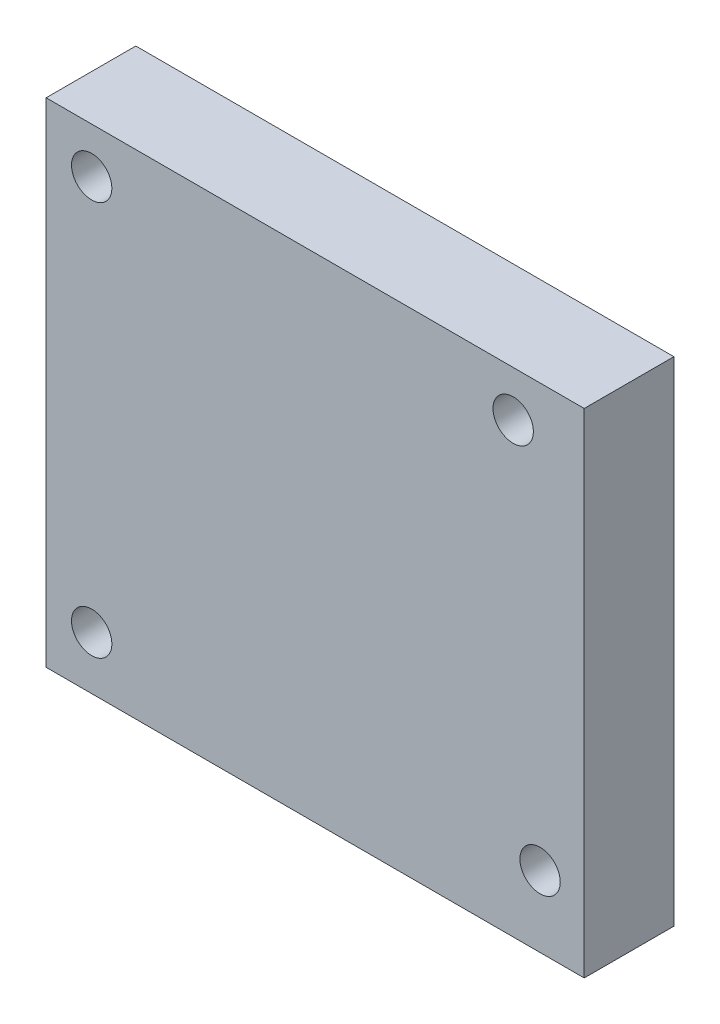
ISO-10303-21;
HEADER;
FILE_DESCRIPTION(('STEP AP214'),'2;1');
FILE_NAME('part.step','',(''),(''),'','','');
FILE_SCHEMA(('AUTOMOTIVE_DESIGN { 1 0 10303 214 1 1 1 1 }'));
ENDSEC;
DATA;
#1=APPLICATION_CONTEXT('core data for automotive mechanical design processes');
#2=APPLICATION_PROTOCOL_DEFINITION('international standard','automotive_design',2000,#1);
#3=PRODUCT_CONTEXT('',#1,'mechanical');
#4=PRODUCT('Part','Part','',(#3));
#5=PRODUCT_RELATED_PRODUCT_CATEGORY('part','',(#4));
#6=PRODUCT_DEFINITION_FORMATION('','',#4);
#7=PRODUCT_DEFINITION_CONTEXT('part definition',#1,'design');
#8=PRODUCT_DEFINITION('design','',#6,#7);
#9=PRODUCT_DEFINITION_SHAPE('','',#8);
#10=(LENGTH_UNIT() NAMED_UNIT(*) SI_UNIT(.MILLI.,.METRE.));
#11=(NAMED_UNIT(*) PLANE_ANGLE_UNIT() SI_UNIT($,.RADIAN.));
#12=(NAMED_UNIT(*) SI_UNIT($,.STERADIAN.) SOLID_ANGLE_UNIT());
#13=UNCERTAINTY_MEASURE_WITH_UNIT(LENGTH_MEASURE(1.E-05),#10,'distance_accuracy_value','');
#14=(GEOMETRIC_REPRESENTATION_CONTEXT(3) GLOBAL_UNCERTAINTY_ASSIGNED_CONTEXT((#13)) GLOBAL_UNIT_ASSIGNED_CONTEXT((#10,
#11,#12)) REPRESENTATION_CONTEXT('',''));
#15=CARTESIAN_POINT('',(0.,0.,0.));
#16=DIRECTION('',(0.,0.,1.));
#17=DIRECTION('',(1.,0.,0.));
#18=AXIS2_PLACEMENT_3D('',#15,#16,#17);
#19=CARTESIAN_POINT('',(0.,0.,10.));
#20=DIRECTION('',(0.,0.,-1.));
#21=DIRECTION('',(-1.,0.,0.));
#22=AXIS2_PLACEMENT_3D('',#19,#20,#21);
#23=PLANE('',#22);
#24=DIRECTION('',(0.,1.,0.));
#25=VECTOR('',#24,1.);
#26=CARTESIAN_POINT('',(29.999999944,-30.,10.));
#27=LINE('',#26,#25);
#28=CARTESIAN_POINT('',(29.999999944,-30.,10.));
#29=VERTEX_POINT('',#28);
#30=CARTESIAN_POINT('',(29.999999944,25.,10.));
#31=VERTEX_POINT('',#30);
#32=EDGE_CURVE('E85',#29,#31,#27,.T.);
#33=ORIENTED_EDGE('',*,*,#32,.T.);
#34=DIRECTION('',(-1.,0.,0.));
#35=VECTOR('',#34,1.);
#36=CARTESIAN_POINT('',(-29.999999944,25.,10.));
#37=LINE('',#36,#35);
#38=CARTESIAN_POINT('',(-29.999999944,25.,10.));
#39=VERTEX_POINT('',#38);
#40=EDGE_CURVE('E80',#31,#39,#37,.T.);
#41=ORIENTED_EDGE('',*,*,#40,.T.);
#42=DIRECTION('',(0.,-1.,0.));
#43=VECTOR('',#42,1.);
#44=CARTESIAN_POINT('',(-29.999999944,-30.,10.));
#45=LINE('',#44,#43);
#46=CARTESIAN_POINT('',(-29.999999944,-30.,10.));
#47=VERTEX_POINT('',#46);
#48=EDGE_CURVE('E83',#39,#47,#45,.T.);
#49=ORIENTED_EDGE('',*,*,#48,.T.);
#50=DIRECTION('',(1.,0.,0.));
#51=VECTOR('',#50,1.);
#52=CARTESIAN_POINT('',(-29.999999944,-30.,10.));
#53=LINE('',#52,#51);
#54=EDGE_CURVE('E50',#47,#29,#53,.T.);
#55=ORIENTED_EDGE('',*,*,#54,.T.);
#56=EDGE_LOOP('',(#33,#41,#49,#55));
#57=FACE_BOUND('',#56,.T.);
#58=CARTESIAN_POINT('',(-24.919999944,19.92,10.));
#59=DIRECTION('',(0.,0.,1.));
#60=DIRECTION('',(1.,0.,0.));
#61=AXIS2_PLACEMENT_3D('',#58,#59,#60);
#62=CIRCLE('',#61,2.25);
#63=CARTESIAN_POINT('',(-22.669999944,19.92,10.));
#64=VERTEX_POINT('',#63);
#65=EDGE_CURVE('E100',#64,#64,#62,.T.);
#66=ORIENTED_EDGE('',*,*,#65,.F.);
#67=EDGE_LOOP('',(#66));
#68=FACE_BOUND('',#67,.T.);
#69=CARTESIAN_POINT('',(-24.919999944,-24.08,10.));
#70=DIRECTION('',(0.,0.,1.));
#71=DIRECTION('',(1.,0.,0.));
#72=AXIS2_PLACEMENT_3D('',#69,#70,#71);
#73=CIRCLE('',#72,2.25);
#74=CARTESIAN_POINT('',(-22.669999944,-24.08,10.));
#75=VERTEX_POINT('',#74);
#76=EDGE_CURVE('E115',#75,#75,#73,.T.);
#77=ORIENTED_EDGE('',*,*,#76,.F.);
#78=EDGE_LOOP('',(#77));
#79=FACE_BOUND('',#78,.T.);
#80=CARTESIAN_POINT('',(25.080000056,-22.08,10.));
#81=DIRECTION('',(0.,0.,1.));
#82=DIRECTION('',(1.,0.,0.));
#83=AXIS2_PLACEMENT_3D('',#80,#81,#82);
#84=CIRCLE('',#83,2.25);
#85=CARTESIAN_POINT('',(27.330000056,-22.08,10.));
#86=VERTEX_POINT('',#85);
#87=EDGE_CURVE('E121',#86,#86,#84,.T.);
#88=ORIENTED_EDGE('',*,*,#87,.F.);
#89=EDGE_LOOP('',(#88));
#90=FACE_BOUND('',#89,.T.);
#91=CARTESIAN_POINT('',(22.080000056,19.92,10.));
#92=DIRECTION('',(0.,0.,1.));
#93=DIRECTION('',(1.,0.,0.));
#94=AXIS2_PLACEMENT_3D('',#91,#92,#93);
#95=CIRCLE('',#94,2.25);
#96=CARTESIAN_POINT('',(24.330000056,19.92,10.));
#97=VERTEX_POINT('',#96);
#98=EDGE_CURVE('E127',#97,#97,#95,.T.);
#99=ORIENTED_EDGE('',*,*,#98,.F.);
#100=EDGE_LOOP('',(#99));
#101=FACE_BOUND('',#100,.T.);
#102=ADVANCED_FACE('F33',(#57,#68,#79,#90,#101),#23,.F.);
#103=CARTESIAN_POINT('',(0.,0.,0.));
#104=DIRECTION('',(0.,0.,-1.));
#105=DIRECTION('',(-1.,0.,0.));
#106=AXIS2_PLACEMENT_3D('',#103,#104,#105);
#107=PLANE('',#106);
#108=CARTESIAN_POINT('',(25.080000056,-22.08,0.));
#109=DIRECTION('',(0.,0.,1.));
#110=DIRECTION('',(1.,0.,0.));
#111=AXIS2_PLACEMENT_3D('',#108,#109,#110);
#112=CIRCLE('',#111,2.25);
#113=CARTESIAN_POINT('',(27.330000056,-22.08,0.));
#114=VERTEX_POINT('',#113);
#115=EDGE_CURVE('E124',#114,#114,#112,.T.);
#116=ORIENTED_EDGE('',*,*,#115,.T.);
#117=EDGE_LOOP('',(#116));
#118=FACE_BOUND('',#117,.T.);
#119=CARTESIAN_POINT('',(-24.919999944,19.92,0.));
#120=DIRECTION('',(0.,0.,1.));
#121=DIRECTION('',(1.,0.,0.));
#122=AXIS2_PLACEMENT_3D('',#119,#120,#121);
#123=CIRCLE('',#122,2.25);
#124=CARTESIAN_POINT('',(-22.669999944,19.92,0.));
#125=VERTEX_POINT('',#124);
#126=EDGE_CURVE('E112',#125,#125,#123,.T.);
#127=ORIENTED_EDGE('',*,*,#126,.T.);
#128=EDGE_LOOP('',(#127));
#129=FACE_BOUND('',#128,.T.);
#130=DIRECTION('',(0.,1.,0.));
#131=VECTOR('',#130,1.);
#132=CARTESIAN_POINT('',(29.999999944,-30.,0.));
#133=LINE('',#132,#131);
#134=CARTESIAN_POINT('',(29.999999944,-30.,0.));
#135=VERTEX_POINT('',#134);
#136=CARTESIAN_POINT('',(29.999999944,25.,0.));
#137=VERTEX_POINT('',#136);
#138=EDGE_CURVE('E97',#135,#137,#133,.T.);
#139=ORIENTED_EDGE('',*,*,#138,.F.);
#140=DIRECTION('',(1.,0.,0.));
#141=VECTOR('',#140,1.);
#142=CARTESIAN_POINT('',(-29.999999944,-30.,0.));
#143=LINE('',#142,#141);
#144=CARTESIAN_POINT('',(-29.999999944,-30.,0.));
#145=VERTEX_POINT('',#144);
#146=EDGE_CURVE('E73',#145,#135,#143,.T.);
#147=ORIENTED_EDGE('',*,*,#146,.F.);
#148=DIRECTION('',(0.,-1.,0.));
#149=VECTOR('',#148,1.);
#150=CARTESIAN_POINT('',(-29.999999944,-30.,0.));
#151=LINE('',#150,#149);
#152=CARTESIAN_POINT('',(-29.999999944,25.,0.));
#153=VERTEX_POINT('',#152);
#154=EDGE_CURVE('E67',#153,#145,#151,.T.);
#155=ORIENTED_EDGE('',*,*,#154,.F.);
#156=DIRECTION('',(-1.,0.,0.));
#157=VECTOR('',#156,1.);
#158=CARTESIAN_POINT('',(-29.999999944,25.,0.));
#159=LINE('',#158,#157);
#160=EDGE_CURVE('E89',#137,#153,#159,.T.);
#161=ORIENTED_EDGE('',*,*,#160,.F.);
#162=EDGE_LOOP('',(#139,#147,#155,#161));
#163=FACE_BOUND('',#162,.T.);
#164=CARTESIAN_POINT('',(-24.919999944,-24.08,0.));
#165=DIRECTION('',(0.,0.,1.));
#166=DIRECTION('',(1.,0.,0.));
#167=AXIS2_PLACEMENT_3D('',#164,#165,#166);
#168=CIRCLE('',#167,2.25);
#169=CARTESIAN_POINT('',(-22.669999944,-24.08,0.));
#170=VERTEX_POINT('',#169);
#171=EDGE_CURVE('E118',#170,#170,#168,.T.);
#172=ORIENTED_EDGE('',*,*,#171,.T.);
#173=EDGE_LOOP('',(#172));
#174=FACE_BOUND('',#173,.T.);
#175=CARTESIAN_POINT('',(22.080000056,19.92,0.));
#176=DIRECTION('',(0.,0.,1.));
#177=DIRECTION('',(1.,0.,0.));
#178=AXIS2_PLACEMENT_3D('',#175,#176,#177);
#179=CIRCLE('',#178,2.25);
#180=CARTESIAN_POINT('',(24.330000056,19.92,0.));
#181=VERTEX_POINT('',#180);
#182=EDGE_CURVE('E130',#181,#181,#179,.T.);
#183=ORIENTED_EDGE('',*,*,#182,.T.);
#184=EDGE_LOOP('',(#183));
#185=FACE_BOUND('',#184,.T.);
#186=ADVANCED_FACE('F108',(#118,#129,#163,#174,#185),#107,.T.);
#187=CARTESIAN_POINT('',(29.999999944,-30.,10.));
#188=DIRECTION('',(-1.,0.,0.));
#189=DIRECTION('',(0.,-1.,0.));
#190=AXIS2_PLACEMENT_3D('',#187,#188,#189);
#191=PLANE('',#190);
#192=ORIENTED_EDGE('',*,*,#138,.T.);
#193=DIRECTION('',(0.,0.,-1.));
#194=VECTOR('',#193,1.);
#195=CARTESIAN_POINT('',(29.999999944,25.,10.));
#196=LINE('',#195,#194);
#197=EDGE_CURVE('E11',#31,#137,#196,.T.);
#198=ORIENTED_EDGE('',*,*,#197,.F.);
#199=ORIENTED_EDGE('',*,*,#32,.F.);
#200=DIRECTION('',(0.,0.,-1.));
#201=VECTOR('',#200,1.);
#202=CARTESIAN_POINT('',(29.999999944,-30.,10.));
#203=LINE('',#202,#201);
#204=EDGE_CURVE('E93',#29,#135,#203,.T.);
#205=ORIENTED_EDGE('',*,*,#204,.T.);
#206=EDGE_LOOP('',(#192,#198,#199,#205));
#207=FACE_BOUND('',#206,.T.);
#208=ADVANCED_FACE('F35',(#207),#191,.F.);
#209=CARTESIAN_POINT('',(-29.999999944,25.,10.));
#210=DIRECTION('',(0.,-1.,0.));
#211=DIRECTION('',(1.,0.,0.));
#212=AXIS2_PLACEMENT_3D('',#209,#210,#211);
#213=PLANE('',#212);
#214=ORIENTED_EDGE('',*,*,#160,.T.);
#215=DIRECTION('',(0.,0.,-1.));
#216=VECTOR('',#215,1.);
#217=CARTESIAN_POINT('',(-29.999999944,25.,10.));
#218=LINE('',#217,#216);
#219=EDGE_CURVE('E42',#39,#153,#218,.T.);
#220=ORIENTED_EDGE('',*,*,#219,.F.);
#221=ORIENTED_EDGE('',*,*,#40,.F.);
#222=ORIENTED_EDGE('',*,*,#197,.T.);
#223=EDGE_LOOP('',(#214,#220,#221,#222));
#224=FACE_BOUND('',#223,.T.);
#225=ADVANCED_FACE('F88',(#224),#213,.F.);
#226=CARTESIAN_POINT('',(-29.999999944,-30.,10.));
#227=DIRECTION('',(1.,0.,0.));
#228=DIRECTION('',(0.,1.,0.));
#229=AXIS2_PLACEMENT_3D('',#226,#227,#228);
#230=PLANE('',#229);
#231=ORIENTED_EDGE('',*,*,#154,.T.);
#232=DIRECTION('',(0.,0.,-1.));
#233=VECTOR('',#232,1.);
#234=CARTESIAN_POINT('',(-29.999999944,-30.,10.));
#235=LINE('',#234,#233);
#236=EDGE_CURVE('E90',#47,#145,#235,.T.);
#237=ORIENTED_EDGE('',*,*,#236,.F.);
#238=ORIENTED_EDGE('',*,*,#48,.F.);
#239=ORIENTED_EDGE('',*,*,#219,.T.);
#240=EDGE_LOOP('',(#231,#237,#238,#239));
#241=FACE_BOUND('',#240,.T.);
#242=ADVANCED_FACE('F91',(#241),#230,.F.);
#243=CARTESIAN_POINT('',(-29.999999944,-30.,10.));
#244=DIRECTION('',(0.,1.,0.));
#245=DIRECTION('',(-1.,0.,0.));
#246=AXIS2_PLACEMENT_3D('',#243,#244,#245);
#247=PLANE('',#246);
#248=ORIENTED_EDGE('',*,*,#146,.T.);
#249=ORIENTED_EDGE('',*,*,#204,.F.);
#250=ORIENTED_EDGE('',*,*,#54,.F.);
#251=ORIENTED_EDGE('',*,*,#236,.T.);
#252=EDGE_LOOP('',(#248,#249,#250,#251));
#253=FACE_BOUND('',#252,.T.);
#254=ADVANCED_FACE('F105',(#253),#247,.F.);
#255=CARTESIAN_POINT('',(-24.919999944,19.92,10.));
#256=DIRECTION('',(0.,0.,-1.));
#257=DIRECTION('',(-1.,0.,0.));
#258=AXIS2_PLACEMENT_3D('',#255,#256,#257);
#259=CYLINDRICAL_SURFACE('',#258,2.25);
#260=ORIENTED_EDGE('',*,*,#65,.T.);
#261=EDGE_LOOP('',(#260));
#262=FACE_BOUND('',#261,.T.);
#263=ORIENTED_EDGE('',*,*,#126,.F.);
#264=EDGE_LOOP('',(#263));
#265=FACE_BOUND('',#264,.T.);
#266=ADVANCED_FACE('F147',(#262,#265),#259,.F.);
#267=CARTESIAN_POINT('',(-24.919999944,-24.08,10.));
#268=DIRECTION('',(0.,0.,-1.));
#269=DIRECTION('',(-1.,0.,0.));
#270=AXIS2_PLACEMENT_3D('',#267,#268,#269);
#271=CYLINDRICAL_SURFACE('',#270,2.25);
#272=ORIENTED_EDGE('',*,*,#76,.T.);
#273=EDGE_LOOP('',(#272));
#274=FACE_BOUND('',#273,.T.);
#275=ORIENTED_EDGE('',*,*,#171,.F.);
#276=EDGE_LOOP('',(#275));
#277=FACE_BOUND('',#276,.T.);
#278=ADVANCED_FACE('F193',(#274,#277),#271,.F.);
#279=CARTESIAN_POINT('',(25.080000056,-22.08,10.));
#280=DIRECTION('',(0.,0.,-1.));
#281=DIRECTION('',(-1.,0.,0.));
#282=AXIS2_PLACEMENT_3D('',#279,#280,#281);
#283=CYLINDRICAL_SURFACE('',#282,2.25);
#284=ORIENTED_EDGE('',*,*,#87,.T.);
#285=EDGE_LOOP('',(#284));
#286=FACE_BOUND('',#285,.T.);
#287=ORIENTED_EDGE('',*,*,#115,.F.);
#288=EDGE_LOOP('',(#287));
#289=FACE_BOUND('',#288,.T.);
#290=ADVANCED_FACE('F201',(#286,#289),#283,.F.);
#291=CARTESIAN_POINT('',(22.080000056,19.92,10.));
#292=DIRECTION('',(0.,0.,-1.));
#293=DIRECTION('',(-1.,0.,0.));
#294=AXIS2_PLACEMENT_3D('',#291,#292,#293);
#295=CYLINDRICAL_SURFACE('',#294,2.25);
#296=ORIENTED_EDGE('',*,*,#98,.T.);
#297=EDGE_LOOP('',(#296));
#298=FACE_BOUND('',#297,.T.);
#299=ORIENTED_EDGE('',*,*,#182,.F.);
#300=EDGE_LOOP('',(#299));
#301=FACE_BOUND('',#300,.T.);
#302=ADVANCED_FACE('F136',(#298,#301),#295,.F.);
#303=CLOSED_SHELL('',(#102,#186,#208,#225,#242,#254,#266,#278,#290,#302));
#304=MANIFOLD_SOLID_BREP('B2',#303);
#305=ADVANCED_BREP_SHAPE_REPRESENTATION('',(#18,#304),#14);
#306=SHAPE_DEFINITION_REPRESENTATION(#9,#305);
ENDSEC;
END-ISO-10303-21;
